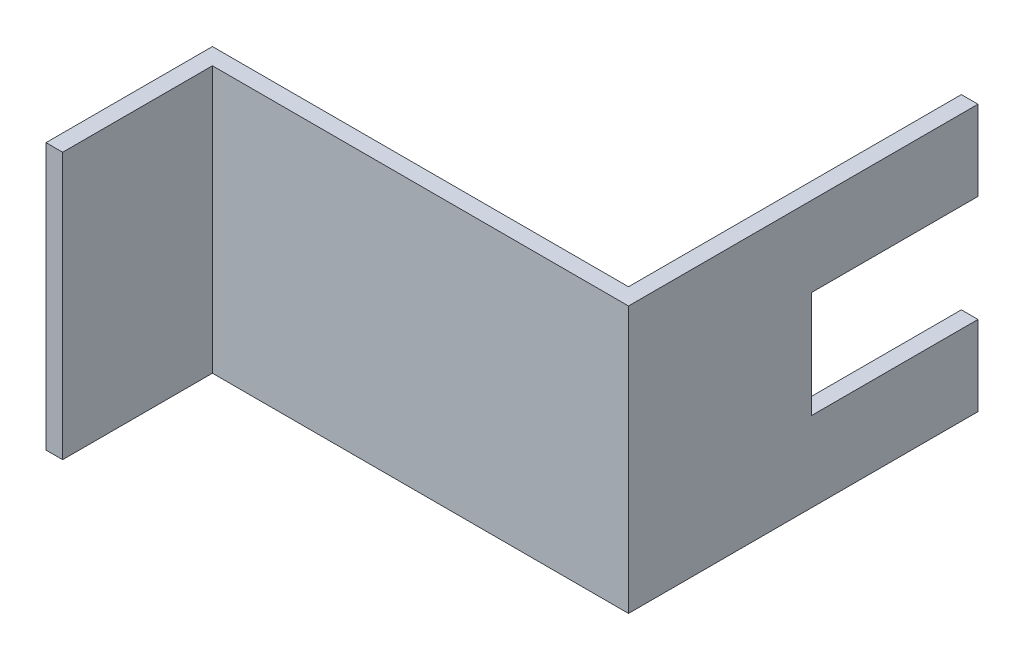
ISO-10303-21;
HEADER;
FILE_DESCRIPTION(('STEP AP214'),'2;1');
FILE_NAME('part.step','',(''),(''),'','','');
FILE_SCHEMA(('AUTOMOTIVE_DESIGN { 1 0 10303 214 1 1 1 1 }'));
ENDSEC;
DATA;
#1=APPLICATION_CONTEXT('core data for automotive mechanical design processes');
#2=APPLICATION_PROTOCOL_DEFINITION('international standard','automotive_design',2000,#1);
#3=PRODUCT_CONTEXT('',#1,'mechanical');
#4=PRODUCT('Part','Part','',(#3));
#5=PRODUCT_RELATED_PRODUCT_CATEGORY('part','',(#4));
#6=PRODUCT_DEFINITION_FORMATION('','',#4);
#7=PRODUCT_DEFINITION_CONTEXT('part definition',#1,'design');
#8=PRODUCT_DEFINITION('design','',#6,#7);
#9=PRODUCT_DEFINITION_SHAPE('','',#8);
#10=(LENGTH_UNIT() NAMED_UNIT(*) SI_UNIT(.MILLI.,.METRE.));
#11=(NAMED_UNIT(*) PLANE_ANGLE_UNIT() SI_UNIT($,.RADIAN.));
#12=(NAMED_UNIT(*) SI_UNIT($,.STERADIAN.) SOLID_ANGLE_UNIT());
#13=UNCERTAINTY_MEASURE_WITH_UNIT(LENGTH_MEASURE(1.E-05),#10,'distance_accuracy_value','');
#14=(GEOMETRIC_REPRESENTATION_CONTEXT(3) GLOBAL_UNCERTAINTY_ASSIGNED_CONTEXT((#13)) GLOBAL_UNIT_ASSIGNED_CONTEXT((#10,
#11,#12)) REPRESENTATION_CONTEXT('',''));
#15=CARTESIAN_POINT('',(0.,0.,0.));
#16=DIRECTION('',(0.,0.,1.));
#17=DIRECTION('',(1.,0.,0.));
#18=AXIS2_PLACEMENT_3D('',#15,#16,#17);
#19=CARTESIAN_POINT('',(-2.07044485011699E-13,25.4,-23.6841148249143));
#20=DIRECTION('',(0.,0.,1.));
#21=DIRECTION('',(1.,0.,0.));
#22=AXIS2_PLACEMENT_3D('',#19,#20,#21);
#23=PLANE('',#22);
#24=DIRECTION('',(0.,-1.,0.));
#25=VECTOR('',#24,1.);
#26=CARTESIAN_POINT('',(24.8889133228681,25.4,-23.6841148249145));
#27=LINE('',#26,#25);
#28=CARTESIAN_POINT('',(24.8889133228681,7.62,-23.6841148249146));
#29=VERTEX_POINT('',#28);
#30=CARTESIAN_POINT('',(24.8889133228681,0.,-23.6841148249145));
#31=VERTEX_POINT('',#30);
#32=EDGE_CURVE('E166',#29,#31,#27,.T.);
#33=ORIENTED_EDGE('',*,*,#32,.F.);
#34=DIRECTION('',(1.,0.,0.));
#35=VECTOR('',#34,1.);
#36=CARTESIAN_POINT('',(1.07641332286808,7.62,-23.6841148249146));
#37=LINE('',#36,#35);
#38=CARTESIAN_POINT('',(26.4764133228681,7.62,-23.6841148249146));
#39=VERTEX_POINT('',#38);
#40=EDGE_CURVE('E147',#29,#39,#37,.T.);
#41=ORIENTED_EDGE('',*,*,#40,.T.);
#42=DIRECTION('',(0.,-1.,0.));
#43=VECTOR('',#42,1.);
#44=CARTESIAN_POINT('',(26.4764133228681,25.4,-23.6841148249146));
#45=LINE('',#44,#43);
#46=CARTESIAN_POINT('',(26.4764133228681,0.,-23.6841148249146));
#47=VERTEX_POINT('',#46);
#48=EDGE_CURVE('E170',#39,#47,#45,.T.);
#49=ORIENTED_EDGE('',*,*,#48,.T.);
#50=DIRECTION('',(-1.,0.,0.));
#51=VECTOR('',#50,1.);
#52=CARTESIAN_POINT('',(-2.07044485011699E-13,0.,-23.6841148249143));
#53=LINE('',#52,#51);
#54=EDGE_CURVE('E152',#47,#31,#53,.T.);
#55=ORIENTED_EDGE('',*,*,#54,.T.);
#56=EDGE_LOOP('',(#33,#41,#49,#55));
#57=FACE_BOUND('',#56,.T.);
#58=ADVANCED_FACE('F35',(#57),#23,.F.);
#59=CARTESIAN_POINT('',(-13.2110866771319,25.4,0.));
#60=DIRECTION('',(-1.,0.,0.));
#61=DIRECTION('',(0.,0.,1.));
#62=AXIS2_PLACEMENT_3D('',#59,#60,#61);
#63=PLANE('',#62);
#64=DIRECTION('',(0.,0.,-1.));
#65=VECTOR('',#64,1.);
#66=CARTESIAN_POINT('',(-13.2110866771319,0.,0.));
#67=LINE('',#66,#65);
#68=CARTESIAN_POINT('',(-13.2110866771319,0.,23.9408851750854));
#69=VERTEX_POINT('',#68);
#70=CARTESIAN_POINT('',(-13.2110866771319,0.,9.65338517508546));
#71=VERTEX_POINT('',#70);
#72=EDGE_CURVE('E143',#69,#71,#67,.T.);
#73=ORIENTED_EDGE('',*,*,#72,.T.);
#74=DIRECTION('',(0.,-1.,0.));
#75=VECTOR('',#74,1.);
#76=CARTESIAN_POINT('',(-13.2110866771319,25.4,9.65338517508546));
#77=LINE('',#76,#75);
#78=CARTESIAN_POINT('',(-13.2110866771319,25.4,9.65338517508546));
#79=VERTEX_POINT('',#78);
#80=EDGE_CURVE('E177',#79,#71,#77,.T.);
#81=ORIENTED_EDGE('',*,*,#80,.F.);
#82=DIRECTION('',(0.,0.,-1.));
#83=VECTOR('',#82,1.);
#84=CARTESIAN_POINT('',(-13.2110866771319,25.4,0.));
#85=LINE('',#84,#83);
#86=CARTESIAN_POINT('',(-13.2110866771319,25.4,23.9408851750854));
#87=VERTEX_POINT('',#86);
#88=EDGE_CURVE('E162',#87,#79,#85,.T.);
#89=ORIENTED_EDGE('',*,*,#88,.F.);
#90=DIRECTION('',(0.,-1.,0.));
#91=VECTOR('',#90,1.);
#92=CARTESIAN_POINT('',(-13.2110866771319,25.4,23.9408851750854));
#93=LINE('',#92,#91);
#94=EDGE_CURVE('E139',#87,#69,#93,.T.);
#95=ORIENTED_EDGE('',*,*,#94,.T.);
#96=EDGE_LOOP('',(#73,#81,#89,#95));
#97=FACE_BOUND('',#96,.T.);
#98=ADVANCED_FACE('F37',(#97),#63,.F.);
#99=CARTESIAN_POINT('',(0.,25.4,9.65338517508546));
#100=DIRECTION('',(0.,0.,-1.));
#101=DIRECTION('',(-1.,0.,0.));
#102=AXIS2_PLACEMENT_3D('',#99,#100,#101);
#103=PLANE('',#102);
#104=DIRECTION('',(1.,0.,0.));
#105=VECTOR('',#104,1.);
#106=CARTESIAN_POINT('',(0.,0.,9.65338517508546));
#107=LINE('',#106,#105);
#108=CARTESIAN_POINT('',(26.4764133228681,0.,9.65338517508546));
#109=VERTEX_POINT('',#108);
#110=EDGE_CURVE('E146',#71,#109,#107,.T.);
#111=ORIENTED_EDGE('',*,*,#110,.T.);
#112=DIRECTION('',(0.,-1.,0.));
#113=VECTOR('',#112,1.);
#114=CARTESIAN_POINT('',(26.4764133228681,25.4,9.65338517508546));
#115=LINE('',#114,#113);
#116=CARTESIAN_POINT('',(26.4764133228681,25.4,9.65338517508546));
#117=VERTEX_POINT('',#116);
#118=EDGE_CURVE('E174',#117,#109,#115,.T.);
#119=ORIENTED_EDGE('',*,*,#118,.F.);
#120=DIRECTION('',(1.,0.,0.));
#121=VECTOR('',#120,1.);
#122=CARTESIAN_POINT('',(0.,25.4,9.65338517508546));
#123=LINE('',#122,#121);
#124=EDGE_CURVE('E101',#79,#117,#123,.T.);
#125=ORIENTED_EDGE('',*,*,#124,.F.);
#126=ORIENTED_EDGE('',*,*,#80,.T.);
#127=EDGE_LOOP('',(#111,#119,#125,#126));
#128=FACE_BOUND('',#127,.T.);
#129=ADVANCED_FACE('F230',(#128),#103,.F.);
#130=CARTESIAN_POINT('',(26.4764133228681,25.4,0.));
#131=DIRECTION('',(-1.,0.,0.));
#132=DIRECTION('',(0.,0.,1.));
#133=AXIS2_PLACEMENT_3D('',#130,#131,#132);
#134=PLANE('',#133);
#135=ORIENTED_EDGE('',*,*,#48,.F.);
#136=DIRECTION('',(0.,0.,-1.));
#137=VECTOR('',#136,1.);
#138=CARTESIAN_POINT('',(26.4764133228681,7.62,-23.6841148249146));
#139=LINE('',#138,#137);
#140=CARTESIAN_POINT('',(26.4764133228681,7.62,-7.80911482491456));
#141=VERTEX_POINT('',#140);
#142=EDGE_CURVE('E207',#141,#39,#139,.T.);
#143=ORIENTED_EDGE('',*,*,#142,.F.);
#144=DIRECTION('',(0.,-1.,0.));
#145=VECTOR('',#144,1.);
#146=CARTESIAN_POINT('',(26.4764133228681,17.78,-7.80911482491456));
#147=LINE('',#146,#145);
#148=CARTESIAN_POINT('',(26.4764133228681,17.78,-7.80911482491456));
#149=VERTEX_POINT('',#148);
#150=EDGE_CURVE('E211',#149,#141,#147,.T.);
#151=ORIENTED_EDGE('',*,*,#150,.F.);
#152=DIRECTION('',(0.,0.,1.));
#153=VECTOR('',#152,1.);
#154=CARTESIAN_POINT('',(26.4764133228681,17.78,-23.6841148249146));
#155=LINE('',#154,#153);
#156=CARTESIAN_POINT('',(26.4764133228681,17.78,-23.6841148249146));
#157=VERTEX_POINT('',#156);
#158=EDGE_CURVE('E236',#157,#149,#155,.T.);
#159=ORIENTED_EDGE('',*,*,#158,.F.);
#160=CARTESIAN_POINT('',(26.4764133228681,25.4,-23.6841148249146));
#161=VERTEX_POINT('',#160);
#162=EDGE_CURVE('E171',#161,#157,#45,.T.);
#163=ORIENTED_EDGE('',*,*,#162,.F.);
#164=DIRECTION('',(0.,0.,-1.));
#165=VECTOR('',#164,1.);
#166=CARTESIAN_POINT('',(26.4764133228681,25.4,0.));
#167=LINE('',#166,#165);
#168=EDGE_CURVE('E217',#117,#161,#167,.T.);
#169=ORIENTED_EDGE('',*,*,#168,.F.);
#170=ORIENTED_EDGE('',*,*,#118,.T.);
#171=DIRECTION('',(0.,0.,-1.));
#172=VECTOR('',#171,1.);
#173=CARTESIAN_POINT('',(26.4764133228681,0.,0.));
#174=LINE('',#173,#172);
#175=EDGE_CURVE('E149',#109,#47,#174,.T.);
#176=ORIENTED_EDGE('',*,*,#175,.T.);
#177=EDGE_LOOP('',(#135,#143,#151,#159,#163,#169,#170,#176));
#178=FACE_BOUND('',#177,.T.);
#179=ADVANCED_FACE('F234',(#178),#134,.F.);
#180=ORIENTED_EDGE('',*,*,#162,.T.);
#181=DIRECTION('',(1.,0.,0.));
#182=VECTOR('',#181,1.);
#183=CARTESIAN_POINT('',(1.07641332286808,17.78,-23.6841148249146));
#184=LINE('',#183,#182);
#185=CARTESIAN_POINT('',(24.8889133228681,17.78,-23.6841148249146));
#186=VERTEX_POINT('',#185);
#187=EDGE_CURVE('E199',#186,#157,#184,.T.);
#188=ORIENTED_EDGE('',*,*,#187,.F.);
#189=CARTESIAN_POINT('',(24.8889133228681,25.4,-23.6841148249145));
#190=VERTEX_POINT('',#189);
#191=EDGE_CURVE('E167',#190,#186,#27,.T.);
#192=ORIENTED_EDGE('',*,*,#191,.F.);
#193=DIRECTION('',(-1.,0.,0.));
#194=VECTOR('',#193,1.);
#195=CARTESIAN_POINT('',(-2.07044485011699E-13,25.4,-23.6841148249143));
#196=LINE('',#195,#194);
#197=EDGE_CURVE('E219',#161,#190,#196,.T.);
#198=ORIENTED_EDGE('',*,*,#197,.F.);
#199=EDGE_LOOP('',(#180,#188,#192,#198));
#200=FACE_BOUND('',#199,.T.);
#201=ADVANCED_FACE('F204',(#200),#23,.F.);
#202=CARTESIAN_POINT('',(24.8889133228681,25.4,0.));
#203=DIRECTION('',(-1.,0.,0.));
#204=DIRECTION('',(0.,0.,1.));
#205=AXIS2_PLACEMENT_3D('',#202,#203,#204);
#206=PLANE('',#205);
#207=DIRECTION('',(0.,0.,1.));
#208=VECTOR('',#207,1.);
#209=CARTESIAN_POINT('',(24.8889133228681,7.62,0.));
#210=LINE('',#209,#208);
#211=CARTESIAN_POINT('',(24.8889133228681,7.62,-7.80911482491456));
#212=VERTEX_POINT('',#211);
#213=EDGE_CURVE('E11',#29,#212,#210,.T.);
#214=ORIENTED_EDGE('',*,*,#213,.F.);
#215=ORIENTED_EDGE('',*,*,#32,.T.);
#216=DIRECTION('',(0.,0.,-1.));
#217=VECTOR('',#216,1.);
#218=CARTESIAN_POINT('',(24.8889133228681,0.,0.));
#219=LINE('',#218,#217);
#220=CARTESIAN_POINT('',(24.8889133228681,0.,8.06588517508546));
#221=VERTEX_POINT('',#220);
#222=EDGE_CURVE('E155',#221,#31,#219,.T.);
#223=ORIENTED_EDGE('',*,*,#222,.F.);
#224=DIRECTION('',(0.,-1.,0.));
#225=VECTOR('',#224,1.);
#226=CARTESIAN_POINT('',(24.8889133228681,25.4,8.06588517508546));
#227=LINE('',#226,#225);
#228=CARTESIAN_POINT('',(24.8889133228681,25.4,8.06588517508546));
#229=VERTEX_POINT('',#228);
#230=EDGE_CURVE('E134',#229,#221,#227,.T.);
#231=ORIENTED_EDGE('',*,*,#230,.F.);
#232=DIRECTION('',(0.,0.,-1.));
#233=VECTOR('',#232,1.);
#234=CARTESIAN_POINT('',(24.8889133228681,25.4,0.));
#235=LINE('',#234,#233);
#236=EDGE_CURVE('E124',#229,#190,#235,.T.);
#237=ORIENTED_EDGE('',*,*,#236,.T.);
#238=ORIENTED_EDGE('',*,*,#191,.T.);
#239=DIRECTION('',(0.,0.,-1.));
#240=VECTOR('',#239,1.);
#241=CARTESIAN_POINT('',(24.8889133228681,17.78,0.));
#242=LINE('',#241,#240);
#243=CARTESIAN_POINT('',(24.8889133228681,17.78,-7.80911482491456));
#244=VERTEX_POINT('',#243);
#245=EDGE_CURVE('E179',#244,#186,#242,.T.);
#246=ORIENTED_EDGE('',*,*,#245,.F.);
#247=DIRECTION('',(0.,1.,0.));
#248=VECTOR('',#247,1.);
#249=CARTESIAN_POINT('',(24.8889133228681,25.4,-7.80911482491456));
#250=LINE('',#249,#248);
#251=EDGE_CURVE('E43',#212,#244,#250,.T.);
#252=ORIENTED_EDGE('',*,*,#251,.F.);
#253=EDGE_LOOP('',(#214,#215,#223,#231,#237,#238,#246,#252));
#254=FACE_BOUND('',#253,.T.);
#255=ADVANCED_FACE('F192',(#254),#206,.T.);
#256=CARTESIAN_POINT('',(0.,25.4,8.06588517508545));
#257=DIRECTION('',(0.,0.,1.));
#258=DIRECTION('',(1.,0.,0.));
#259=AXIS2_PLACEMENT_3D('',#256,#257,#258);
#260=PLANE('',#259);
#261=DIRECTION('',(-1.,0.,0.));
#262=VECTOR('',#261,1.);
#263=CARTESIAN_POINT('',(0.,0.,8.06588517508545));
#264=LINE('',#263,#262);
#265=CARTESIAN_POINT('',(-14.7985866771319,0.,8.06588517508544));
#266=VERTEX_POINT('',#265);
#267=EDGE_CURVE('E131',#221,#266,#264,.T.);
#268=ORIENTED_EDGE('',*,*,#267,.T.);
#269=DIRECTION('',(0.,-1.,0.));
#270=VECTOR('',#269,1.);
#271=CARTESIAN_POINT('',(-14.7985866771319,25.4,8.06588517508544));
#272=LINE('',#271,#270);
#273=CARTESIAN_POINT('',(-14.7985866771319,25.4,8.06588517508544));
#274=VERTEX_POINT('',#273);
#275=EDGE_CURVE('E128',#274,#266,#272,.T.);
#276=ORIENTED_EDGE('',*,*,#275,.F.);
#277=DIRECTION('',(-1.,0.,0.));
#278=VECTOR('',#277,1.);
#279=CARTESIAN_POINT('',(0.,25.4,8.06588517508545));
#280=LINE('',#279,#278);
#281=EDGE_CURVE('E117',#229,#274,#280,.T.);
#282=ORIENTED_EDGE('',*,*,#281,.F.);
#283=ORIENTED_EDGE('',*,*,#230,.T.);
#284=EDGE_LOOP('',(#268,#276,#282,#283));
#285=FACE_BOUND('',#284,.T.);
#286=ADVANCED_FACE('F129',(#285),#260,.F.);
#287=CARTESIAN_POINT('',(-14.7985866771319,25.4,0.));
#288=DIRECTION('',(1.,0.,0.));
#289=DIRECTION('',(0.,0.,-1.));
#290=AXIS2_PLACEMENT_3D('',#287,#288,#289);
#291=PLANE('',#290);
#292=DIRECTION('',(0.,0.,1.));
#293=VECTOR('',#292,1.);
#294=CARTESIAN_POINT('',(-14.7985866771319,0.,0.));
#295=LINE('',#294,#293);
#296=CARTESIAN_POINT('',(-14.7985866771319,0.,23.9408851750854));
#297=VERTEX_POINT('',#296);
#298=EDGE_CURVE('E159',#266,#297,#295,.T.);
#299=ORIENTED_EDGE('',*,*,#298,.T.);
#300=DIRECTION('',(0.,-1.,0.));
#301=VECTOR('',#300,1.);
#302=CARTESIAN_POINT('',(-14.7985866771319,25.4,23.9408851750854));
#303=LINE('',#302,#301);
#304=CARTESIAN_POINT('',(-14.7985866771319,25.4,23.9408851750854));
#305=VERTEX_POINT('',#304);
#306=EDGE_CURVE('E135',#305,#297,#303,.T.);
#307=ORIENTED_EDGE('',*,*,#306,.F.);
#308=DIRECTION('',(0.,0.,1.));
#309=VECTOR('',#308,1.);
#310=CARTESIAN_POINT('',(-14.7985866771319,25.4,0.));
#311=LINE('',#310,#309);
#312=EDGE_CURVE('E121',#274,#305,#311,.T.);
#313=ORIENTED_EDGE('',*,*,#312,.F.);
#314=ORIENTED_EDGE('',*,*,#275,.T.);
#315=EDGE_LOOP('',(#299,#307,#313,#314));
#316=FACE_BOUND('',#315,.T.);
#317=ADVANCED_FACE('F137',(#316),#291,.F.);
#318=CARTESIAN_POINT('',(0.,25.4,23.9408851750854));
#319=DIRECTION('',(0.,0.,-1.));
#320=DIRECTION('',(-1.,0.,0.));
#321=AXIS2_PLACEMENT_3D('',#318,#319,#320);
#322=PLANE('',#321);
#323=DIRECTION('',(1.,0.,0.));
#324=VECTOR('',#323,1.);
#325=CARTESIAN_POINT('',(0.,0.,23.9408851750854));
#326=LINE('',#325,#324);
#327=EDGE_CURVE('E92',#297,#69,#326,.T.);
#328=ORIENTED_EDGE('',*,*,#327,.T.);
#329=ORIENTED_EDGE('',*,*,#94,.F.);
#330=DIRECTION('',(1.,0.,0.));
#331=VECTOR('',#330,1.);
#332=CARTESIAN_POINT('',(0.,25.4,23.9408851750854));
#333=LINE('',#332,#331);
#334=EDGE_CURVE('E59',#305,#87,#333,.T.);
#335=ORIENTED_EDGE('',*,*,#334,.F.);
#336=ORIENTED_EDGE('',*,*,#306,.T.);
#337=EDGE_LOOP('',(#328,#329,#335,#336));
#338=FACE_BOUND('',#337,.T.);
#339=ADVANCED_FACE('F225',(#338),#322,.F.);
#340=CARTESIAN_POINT('',(0.,25.4,0.));
#341=DIRECTION('',(0.,1.,0.));
#342=DIRECTION('',(0.,0.,1.));
#343=AXIS2_PLACEMENT_3D('',#340,#341,#342);
#344=PLANE('',#343);
#345=ORIENTED_EDGE('',*,*,#88,.T.);
#346=ORIENTED_EDGE('',*,*,#124,.T.);
#347=ORIENTED_EDGE('',*,*,#168,.T.);
#348=ORIENTED_EDGE('',*,*,#197,.T.);
#349=ORIENTED_EDGE('',*,*,#236,.F.);
#350=ORIENTED_EDGE('',*,*,#281,.T.);
#351=ORIENTED_EDGE('',*,*,#312,.T.);
#352=ORIENTED_EDGE('',*,*,#334,.T.);
#353=EDGE_LOOP('',(#345,#346,#347,#348,#349,#350,#351,#352));
#354=FACE_BOUND('',#353,.T.);
#355=ADVANCED_FACE('F119',(#354),#344,.T.);
#356=CARTESIAN_POINT('',(0.,0.,0.));
#357=DIRECTION('',(0.,1.,0.));
#358=DIRECTION('',(0.,0.,1.));
#359=AXIS2_PLACEMENT_3D('',#356,#357,#358);
#360=PLANE('',#359);
#361=ORIENTED_EDGE('',*,*,#72,.F.);
#362=ORIENTED_EDGE('',*,*,#327,.F.);
#363=ORIENTED_EDGE('',*,*,#298,.F.);
#364=ORIENTED_EDGE('',*,*,#267,.F.);
#365=ORIENTED_EDGE('',*,*,#222,.T.);
#366=ORIENTED_EDGE('',*,*,#54,.F.);
#367=ORIENTED_EDGE('',*,*,#175,.F.);
#368=ORIENTED_EDGE('',*,*,#110,.F.);
#369=EDGE_LOOP('',(#361,#362,#363,#364,#365,#366,#367,#368));
#370=FACE_BOUND('',#369,.T.);
#371=ADVANCED_FACE('F223',(#370),#360,.F.);
#372=CARTESIAN_POINT('',(1.07641332286808,7.62,-23.6841148249146));
#373=DIRECTION('',(0.,-1.,0.));
#374=DIRECTION('',(0.,0.,-1.));
#375=AXIS2_PLACEMENT_3D('',#372,#373,#374);
#376=PLANE('',#375);
#377=ORIENTED_EDGE('',*,*,#213,.T.);
#378=DIRECTION('',(1.,0.,0.));
#379=VECTOR('',#378,1.);
#380=CARTESIAN_POINT('',(1.07641332286808,7.62,-7.80911482491456));
#381=LINE('',#380,#379);
#382=EDGE_CURVE('E189',#212,#141,#381,.T.);
#383=ORIENTED_EDGE('',*,*,#382,.T.);
#384=ORIENTED_EDGE('',*,*,#142,.T.);
#385=ORIENTED_EDGE('',*,*,#40,.F.);
#386=EDGE_LOOP('',(#377,#383,#384,#385));
#387=FACE_BOUND('',#386,.T.);
#388=ADVANCED_FACE('F245',(#387),#376,.F.);
#389=CARTESIAN_POINT('',(1.07641332286808,17.78,-7.80911482491456));
#390=DIRECTION('',(0.,0.,1.));
#391=DIRECTION('',(1.,0.,0.));
#392=AXIS2_PLACEMENT_3D('',#389,#390,#391);
#393=PLANE('',#392);
#394=ORIENTED_EDGE('',*,*,#251,.T.);
#395=DIRECTION('',(1.,0.,0.));
#396=VECTOR('',#395,1.);
#397=CARTESIAN_POINT('',(1.07641332286808,17.78,-7.80911482491456));
#398=LINE('',#397,#396);
#399=EDGE_CURVE('E50',#244,#149,#398,.T.);
#400=ORIENTED_EDGE('',*,*,#399,.T.);
#401=ORIENTED_EDGE('',*,*,#150,.T.);
#402=ORIENTED_EDGE('',*,*,#382,.F.);
#403=EDGE_LOOP('',(#394,#400,#401,#402));
#404=FACE_BOUND('',#403,.T.);
#405=ADVANCED_FACE('F184',(#404),#393,.F.);
#406=CARTESIAN_POINT('',(1.07641332286808,17.78,-23.6841148249146));
#407=DIRECTION('',(0.,1.,0.));
#408=DIRECTION('',(0.,0.,1.));
#409=AXIS2_PLACEMENT_3D('',#406,#407,#408);
#410=PLANE('',#409);
#411=ORIENTED_EDGE('',*,*,#245,.T.);
#412=ORIENTED_EDGE('',*,*,#187,.T.);
#413=ORIENTED_EDGE('',*,*,#158,.T.);
#414=ORIENTED_EDGE('',*,*,#399,.F.);
#415=EDGE_LOOP('',(#411,#412,#413,#414));
#416=FACE_BOUND('',#415,.T.);
#417=ADVANCED_FACE('F197',(#416),#410,.F.);
#418=CLOSED_SHELL('',(#58,#98,#129,#179,#201,#255,#286,#317,#339,#355,#371,#388,#405,#417));
#419=MANIFOLD_SOLID_BREP('B2',#418);
#420=ADVANCED_BREP_SHAPE_REPRESENTATION('',(#18,#419),#14);
#421=SHAPE_DEFINITION_REPRESENTATION(#9,#420);
ENDSEC;
END-ISO-10303-21;
